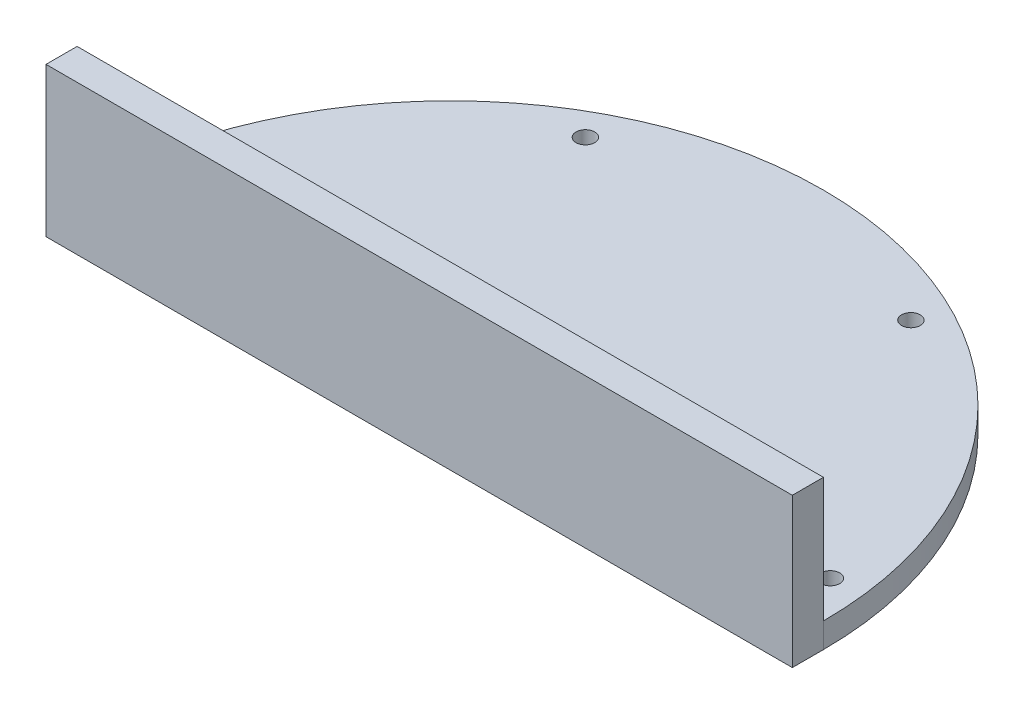
ISO-10303-21;
HEADER;
FILE_DESCRIPTION(('STEP AP214'),'2;1');
FILE_NAME('part.step','',(''),(''),'','','');
FILE_SCHEMA(('AUTOMOTIVE_DESIGN { 1 0 10303 214 1 1 1 1 }'));
ENDSEC;
DATA;
#1=APPLICATION_CONTEXT('core data for automotive mechanical design processes');
#2=APPLICATION_PROTOCOL_DEFINITION('international standard','automotive_design',2000,#1);
#3=PRODUCT_CONTEXT('',#1,'mechanical');
#4=PRODUCT('Part','Part','',(#3));
#5=PRODUCT_RELATED_PRODUCT_CATEGORY('part','',(#4));
#6=PRODUCT_DEFINITION_FORMATION('','',#4);
#7=PRODUCT_DEFINITION_CONTEXT('part definition',#1,'design');
#8=PRODUCT_DEFINITION('design','',#6,#7);
#9=PRODUCT_DEFINITION_SHAPE('','',#8);
#10=(LENGTH_UNIT() NAMED_UNIT(*) SI_UNIT(.MILLI.,.METRE.));
#11=(NAMED_UNIT(*) PLANE_ANGLE_UNIT() SI_UNIT($,.RADIAN.));
#12=(NAMED_UNIT(*) SI_UNIT($,.STERADIAN.) SOLID_ANGLE_UNIT());
#13=UNCERTAINTY_MEASURE_WITH_UNIT(LENGTH_MEASURE(1.E-05),#10,'distance_accuracy_value','');
#14=(GEOMETRIC_REPRESENTATION_CONTEXT(3) GLOBAL_UNCERTAINTY_ASSIGNED_CONTEXT((#13)) GLOBAL_UNIT_ASSIGNED_CONTEXT((#10,
#11,#12)) REPRESENTATION_CONTEXT('',''));
#15=CARTESIAN_POINT('',(0.,0.,0.));
#16=DIRECTION('',(0.,0.,1.));
#17=DIRECTION('',(1.,0.,0.));
#18=AXIS2_PLACEMENT_3D('',#15,#16,#17);
#19=CARTESIAN_POINT('',(0.,5.,0.));
#20=DIRECTION('',(0.,-1.,0.));
#21=DIRECTION('',(0.,0.,-1.));
#22=AXIS2_PLACEMENT_3D('',#19,#20,#21);
#23=CYLINDRICAL_SURFACE('',#22,60.);
#24=DIRECTION('',(0.,-1.,0.));
#25=VECTOR('',#24,1.);
#26=CARTESIAN_POINT('',(60.,5.,0.));
#27=LINE('',#26,#25);
#28=CARTESIAN_POINT('',(60.,10.,0.));
#29=VERTEX_POINT('',#28);
#30=CARTESIAN_POINT('',(60.,5.99999999999998,0.));
#31=VERTEX_POINT('',#30);
#32=EDGE_CURVE('E108',#29,#31,#27,.T.);
#33=ORIENTED_EDGE('',*,*,#32,.T.);
#34=CARTESIAN_POINT('',(0.,5.99999999999998,0.));
#35=DIRECTION('',(0.,1.,0.));
#36=DIRECTION('',(0.,0.,1.));
#37=AXIS2_PLACEMENT_3D('',#34,#35,#36);
#38=CIRCLE('',#37,60.);
#39=CARTESIAN_POINT('',(-60.,5.99999999999998,0.));
#40=VERTEX_POINT('',#39);
#41=EDGE_CURVE('E182',#31,#40,#38,.T.);
#42=ORIENTED_EDGE('',*,*,#41,.T.);
#43=DIRECTION('',(0.,-1.,0.));
#44=VECTOR('',#43,1.);
#45=CARTESIAN_POINT('',(-60.,5.,0.));
#46=LINE('',#45,#44);
#47=CARTESIAN_POINT('',(-60.,10.,0.));
#48=VERTEX_POINT('',#47);
#49=EDGE_CURVE('E153',#48,#40,#46,.T.);
#50=ORIENTED_EDGE('',*,*,#49,.F.);
#51=CARTESIAN_POINT('',(0.,10.,0.));
#52=DIRECTION('',(0.,1.,0.));
#53=DIRECTION('',(0.,0.,1.));
#54=AXIS2_PLACEMENT_3D('',#51,#52,#53);
#55=CIRCLE('',#54,60.);
#56=EDGE_CURVE('E144',#29,#48,#55,.T.);
#57=ORIENTED_EDGE('',*,*,#56,.F.);
#58=EDGE_LOOP('',(#33,#42,#50,#57));
#59=FACE_BOUND('',#58,.T.);
#60=ADVANCED_FACE('F40',(#59),#23,.T.);
#61=CARTESIAN_POINT('',(-54.7722557505166,0.,-5.));
#62=DIRECTION('',(0.,1.,0.));
#63=DIRECTION('',(0.,0.,1.));
#64=AXIS2_PLACEMENT_3D('',#61,#62,#63);
#65=CYLINDRICAL_SURFACE('',#64,1.5);
#66=CARTESIAN_POINT('',(-54.7722557505166,6.00000000000002,-5.));
#67=DIRECTION('',(0.,1.,0.));
#68=DIRECTION('',(0.,0.,1.));
#69=AXIS2_PLACEMENT_3D('',#66,#67,#68);
#70=CIRCLE('',#69,1.5);
#71=CARTESIAN_POINT('',(-54.7722557505166,6.00000000000002,-3.5));
#72=VERTEX_POINT('',#71);
#73=EDGE_CURVE('E155',#72,#72,#70,.F.);
#74=ORIENTED_EDGE('',*,*,#73,.T.);
#75=EDGE_LOOP('',(#74));
#76=FACE_BOUND('',#75,.T.);
#77=CARTESIAN_POINT('',(-54.7722557505166,10.,-5.));
#78=DIRECTION('',(0.,1.,0.));
#79=DIRECTION('',(0.,0.,1.));
#80=AXIS2_PLACEMENT_3D('',#77,#78,#79);
#81=CIRCLE('',#80,1.5);
#82=CARTESIAN_POINT('',(-54.7722557505166,10.,-3.5));
#83=VERTEX_POINT('',#82);
#84=EDGE_CURVE('E136',#83,#83,#81,.T.);
#85=ORIENTED_EDGE('',*,*,#84,.T.);
#86=EDGE_LOOP('',(#85));
#87=FACE_BOUND('',#86,.T.);
#88=ADVANCED_FACE('F239',(#76,#87),#65,.F.);
#89=CARTESIAN_POINT('',(54.6149090032351,0.,-6.49705429932328));
#90=DIRECTION('',(0.,1.,0.));
#91=DIRECTION('',(0.,0.,1.));
#92=AXIS2_PLACEMENT_3D('',#89,#90,#91);
#93=CYLINDRICAL_SURFACE('',#92,1.5);
#94=CARTESIAN_POINT('',(54.6149090032351,6.00000000000002,-6.49705429932328));
#95=DIRECTION('',(0.,1.,0.));
#96=DIRECTION('',(0.,0.,1.));
#97=AXIS2_PLACEMENT_3D('',#94,#95,#96);
#98=CIRCLE('',#97,1.5);
#99=CARTESIAN_POINT('',(54.6149090032351,6.00000000000002,-4.99705429932328));
#100=VERTEX_POINT('',#99);
#101=EDGE_CURVE('E11',#100,#100,#98,.F.);
#102=ORIENTED_EDGE('',*,*,#101,.T.);
#103=EDGE_LOOP('',(#102));
#104=FACE_BOUND('',#103,.T.);
#105=CARTESIAN_POINT('',(54.6149090032351,10.,-6.49705429932328));
#106=DIRECTION('',(0.,1.,0.));
#107=DIRECTION('',(-0.207911690817753,0.,-0.978147600733807));
#108=AXIS2_PLACEMENT_3D('',#105,#106,#107);
#109=CIRCLE('',#108,1.5);
#110=CARTESIAN_POINT('',(54.3030414670084,10.,-7.964275700424));
#111=VERTEX_POINT('',#110);
#112=EDGE_CURVE('E119',#111,#111,#109,.T.);
#113=ORIENTED_EDGE('',*,*,#112,.T.);
#114=EDGE_LOOP('',(#113));
#115=FACE_BOUND('',#114,.T.);
#116=ADVANCED_FACE('F244',(#104,#115),#93,.F.);
#117=CARTESIAN_POINT('',(25.1539674132403,0.,-48.9109182430022));
#118=DIRECTION('',(0.,1.,0.));
#119=DIRECTION('',(0.,0.,1.));
#120=AXIS2_PLACEMENT_3D('',#117,#118,#119);
#121=CYLINDRICAL_SURFACE('',#120,1.5);
#122=CARTESIAN_POINT('',(25.1539674132403,6.00000000000002,-48.9109182430022));
#123=DIRECTION('',(0.,1.,0.));
#124=DIRECTION('',(0.,0.,1.));
#125=AXIS2_PLACEMENT_3D('',#122,#123,#124);
#126=CIRCLE('',#125,1.5);
#127=CARTESIAN_POINT('',(25.1539674132403,6.00000000000002,-47.4109182430022));
#128=VERTEX_POINT('',#127);
#129=EDGE_CURVE('E179',#128,#128,#126,.F.);
#130=ORIENTED_EDGE('',*,*,#129,.T.);
#131=EDGE_LOOP('',(#130));
#132=FACE_BOUND('',#131,.T.);
#133=CARTESIAN_POINT('',(25.1539674132403,10.,-48.9109182430022));
#134=DIRECTION('',(0.,1.,0.));
#135=DIRECTION('',(-0.927183854566786,0.,-0.374606593415916));
#136=AXIS2_PLACEMENT_3D('',#133,#134,#135);
#137=CIRCLE('',#136,1.5);
#138=CARTESIAN_POINT('',(23.7631916313901,10.,-49.4728281331261));
#139=VERTEX_POINT('',#138);
#140=EDGE_CURVE('E137',#139,#139,#137,.T.);
#141=ORIENTED_EDGE('',*,*,#140,.T.);
#142=EDGE_LOOP('',(#141));
#143=FACE_BOUND('',#142,.T.);
#144=ADVANCED_FACE('F299',(#132,#143),#121,.F.);
#145=CARTESIAN_POINT('',(-26.4830688599984,0.,-48.204222468126));
#146=DIRECTION('',(0.,1.,0.));
#147=DIRECTION('',(0.,0.,1.));
#148=AXIS2_PLACEMENT_3D('',#145,#146,#147);
#149=CYLINDRICAL_SURFACE('',#148,1.5);
#150=CARTESIAN_POINT('',(-26.4830688599984,6.00000000000002,-48.204222468126));
#151=DIRECTION('',(0.,1.,0.));
#152=DIRECTION('',(0.,0.,1.));
#153=AXIS2_PLACEMENT_3D('',#150,#151,#152);
#154=CIRCLE('',#153,1.5);
#155=CARTESIAN_POINT('',(-26.4830688599984,6.00000000000002,-46.704222468126));
#156=VERTEX_POINT('',#155);
#157=EDGE_CURVE('E50',#156,#156,#154,.F.);
#158=ORIENTED_EDGE('',*,*,#157,.T.);
#159=EDGE_LOOP('',(#158));
#160=FACE_BOUND('',#159,.T.);
#161=CARTESIAN_POINT('',(-26.4830688599984,10.,-48.204222468126));
#162=DIRECTION('',(0.,1.,0.));
#163=DIRECTION('',(-0.829037572555043,0.,0.559192903470745));
#164=AXIS2_PLACEMENT_3D('',#161,#162,#163);
#165=CIRCLE('',#164,1.5);
#166=CARTESIAN_POINT('',(-27.7266252188309,10.,-47.3654331129199));
#167=VERTEX_POINT('',#166);
#168=EDGE_CURVE('E133',#167,#167,#165,.T.);
#169=ORIENTED_EDGE('',*,*,#168,.T.);
#170=EDGE_LOOP('',(#169));
#171=FACE_BOUND('',#170,.T.);
#172=ADVANCED_FACE('F296',(#160,#171),#149,.F.);
#173=CARTESIAN_POINT('',(-60.,5.,5.));
#174=DIRECTION('',(1.,0.,0.));
#175=DIRECTION('',(0.,0.,-1.));
#176=AXIS2_PLACEMENT_3D('',#173,#174,#175);
#177=PLANE('',#176);
#178=ORIENTED_EDGE('',*,*,#49,.T.);
#179=DIRECTION('',(0.,0.,1.));
#180=VECTOR('',#179,1.);
#181=CARTESIAN_POINT('',(-60.,5.99999999999998,5.));
#182=LINE('',#181,#180);
#183=CARTESIAN_POINT('',(-60.,5.99999999999998,5.));
#184=VERTEX_POINT('',#183);
#185=EDGE_CURVE('E66',#40,#184,#182,.T.);
#186=ORIENTED_EDGE('',*,*,#185,.T.);
#187=DIRECTION('',(0.,-1.,0.));
#188=VECTOR('',#187,1.);
#189=CARTESIAN_POINT('',(-60.,5.,5.));
#190=LINE('',#189,#188);
#191=CARTESIAN_POINT('',(-60.,30.,5.));
#192=VERTEX_POINT('',#191);
#193=EDGE_CURVE('E109',#192,#184,#190,.T.);
#194=ORIENTED_EDGE('',*,*,#193,.F.);
#195=DIRECTION('',(0.,0.,-1.));
#196=VECTOR('',#195,1.);
#197=CARTESIAN_POINT('',(-60.,30.,5.));
#198=LINE('',#197,#196);
#199=CARTESIAN_POINT('',(-60.,30.,0.));
#200=VERTEX_POINT('',#199);
#201=EDGE_CURVE('E120',#192,#200,#198,.T.);
#202=ORIENTED_EDGE('',*,*,#201,.T.);
#203=DIRECTION('',(0.,1.,0.));
#204=VECTOR('',#203,1.);
#205=CARTESIAN_POINT('',(-60.,5.,0.));
#206=LINE('',#205,#204);
#207=EDGE_CURVE('E130',#48,#200,#206,.T.);
#208=ORIENTED_EDGE('',*,*,#207,.F.);
#209=EDGE_LOOP('',(#178,#186,#194,#202,#208));
#210=FACE_BOUND('',#209,.T.);
#211=ADVANCED_FACE('F220',(#210),#177,.F.);
#212=CARTESIAN_POINT('',(60.,5.,5.));
#213=DIRECTION('',(-1.,0.,0.));
#214=DIRECTION('',(0.,0.,1.));
#215=AXIS2_PLACEMENT_3D('',#212,#213,#214);
#216=PLANE('',#215);
#217=DIRECTION('',(0.,1.,0.));
#218=VECTOR('',#217,1.);
#219=CARTESIAN_POINT('',(60.,5.,5.));
#220=LINE('',#219,#218);
#221=CARTESIAN_POINT('',(60.,5.99999999999998,5.));
#222=VERTEX_POINT('',#221);
#223=CARTESIAN_POINT('',(60.,30.,5.));
#224=VERTEX_POINT('',#223);
#225=EDGE_CURVE('E101',#222,#224,#220,.T.);
#226=ORIENTED_EDGE('',*,*,#225,.F.);
#227=DIRECTION('',(0.,0.,-1.));
#228=VECTOR('',#227,1.);
#229=CARTESIAN_POINT('',(60.,5.99999999999998,5.));
#230=LINE('',#229,#228);
#231=EDGE_CURVE('E187',#222,#31,#230,.T.);
#232=ORIENTED_EDGE('',*,*,#231,.T.);
#233=ORIENTED_EDGE('',*,*,#32,.F.);
#234=DIRECTION('',(0.,-1.,0.));
#235=VECTOR('',#234,1.);
#236=CARTESIAN_POINT('',(60.,5.,0.));
#237=LINE('',#236,#235);
#238=CARTESIAN_POINT('',(60.,30.,0.));
#239=VERTEX_POINT('',#238);
#240=EDGE_CURVE('E115',#239,#29,#237,.T.);
#241=ORIENTED_EDGE('',*,*,#240,.F.);
#242=DIRECTION('',(0.,0.,-1.));
#243=VECTOR('',#242,1.);
#244=CARTESIAN_POINT('',(60.,30.,5.));
#245=LINE('',#244,#243);
#246=EDGE_CURVE('E112',#224,#239,#245,.T.);
#247=ORIENTED_EDGE('',*,*,#246,.F.);
#248=EDGE_LOOP('',(#226,#232,#233,#241,#247));
#249=FACE_BOUND('',#248,.T.);
#250=ADVANCED_FACE('F113',(#249),#216,.F.);
#251=CARTESIAN_POINT('',(0.,0.,5.));
#252=DIRECTION('',(0.,0.,1.));
#253=DIRECTION('',(1.,0.,0.));
#254=AXIS2_PLACEMENT_3D('',#251,#252,#253);
#255=PLANE('',#254);
#256=ORIENTED_EDGE('',*,*,#193,.T.);
#257=DIRECTION('',(1.,0.,0.));
#258=VECTOR('',#257,1.);
#259=CARTESIAN_POINT('',(60.,5.99999999999998,5.));
#260=LINE('',#259,#258);
#261=EDGE_CURVE('E58',#184,#222,#260,.T.);
#262=ORIENTED_EDGE('',*,*,#261,.T.);
#263=ORIENTED_EDGE('',*,*,#225,.T.);
#264=DIRECTION('',(1.,0.,0.));
#265=VECTOR('',#264,1.);
#266=CARTESIAN_POINT('',(-60.,30.,5.));
#267=LINE('',#266,#265);
#268=EDGE_CURVE('E105',#192,#224,#267,.T.);
#269=ORIENTED_EDGE('',*,*,#268,.F.);
#270=EDGE_LOOP('',(#256,#262,#263,#269));
#271=FACE_BOUND('',#270,.T.);
#272=ADVANCED_FACE('F103',(#271),#255,.T.);
#273=CARTESIAN_POINT('',(0.,10.,0.));
#274=DIRECTION('',(0.,-1.,0.));
#275=DIRECTION('',(0.,0.,1.));
#276=AXIS2_PLACEMENT_3D('',#273,#274,#275);
#277=PLANE('',#276);
#278=ORIENTED_EDGE('',*,*,#168,.F.);
#279=EDGE_LOOP('',(#278));
#280=FACE_BOUND('',#279,.T.);
#281=ORIENTED_EDGE('',*,*,#140,.F.);
#282=EDGE_LOOP('',(#281));
#283=FACE_BOUND('',#282,.T.);
#284=ORIENTED_EDGE('',*,*,#112,.F.);
#285=EDGE_LOOP('',(#284));
#286=FACE_BOUND('',#285,.T.);
#287=ORIENTED_EDGE('',*,*,#84,.F.);
#288=EDGE_LOOP('',(#287));
#289=FACE_BOUND('',#288,.T.);
#290=ORIENTED_EDGE('',*,*,#56,.T.);
#291=DIRECTION('',(1.,0.,0.));
#292=VECTOR('',#291,1.);
#293=CARTESIAN_POINT('',(-60.,10.,0.));
#294=LINE('',#293,#292);
#295=EDGE_CURVE('E147',#48,#29,#294,.T.);
#296=ORIENTED_EDGE('',*,*,#295,.T.);
#297=EDGE_LOOP('',(#290,#296));
#298=FACE_BOUND('',#297,.T.);
#299=ADVANCED_FACE('F225',(#280,#283,#286,#289,#298),#277,.F.);
#300=CARTESIAN_POINT('',(0.,10.,0.));
#301=DIRECTION('',(0.,0.,1.));
#302=DIRECTION('',(1.,0.,0.));
#303=AXIS2_PLACEMENT_3D('',#300,#301,#302);
#304=PLANE('',#303);
#305=ORIENTED_EDGE('',*,*,#240,.T.);
#306=ORIENTED_EDGE('',*,*,#295,.F.);
#307=ORIENTED_EDGE('',*,*,#207,.T.);
#308=DIRECTION('',(1.,0.,0.));
#309=VECTOR('',#308,1.);
#310=CARTESIAN_POINT('',(-60.,30.,0.));
#311=LINE('',#310,#309);
#312=EDGE_CURVE('E125',#200,#239,#311,.T.);
#313=ORIENTED_EDGE('',*,*,#312,.T.);
#314=EDGE_LOOP('',(#305,#306,#307,#313));
#315=FACE_BOUND('',#314,.T.);
#316=ADVANCED_FACE('F223',(#315),#304,.F.);
#317=CARTESIAN_POINT('',(-60.,30.,5.));
#318=DIRECTION('',(0.,1.,0.));
#319=DIRECTION('',(0.,0.,1.));
#320=AXIS2_PLACEMENT_3D('',#317,#318,#319);
#321=PLANE('',#320);
#322=ORIENTED_EDGE('',*,*,#312,.F.);
#323=ORIENTED_EDGE('',*,*,#201,.F.);
#324=ORIENTED_EDGE('',*,*,#268,.T.);
#325=ORIENTED_EDGE('',*,*,#246,.T.);
#326=EDGE_LOOP('',(#322,#323,#324,#325));
#327=FACE_BOUND('',#326,.T.);
#328=ADVANCED_FACE('F123',(#327),#321,.T.);
#329=CARTESIAN_POINT('',(90.,5.,5.));
#330=DIRECTION('',(0.,1.,0.));
#331=DIRECTION('',(0.,0.,1.));
#332=AXIS2_PLACEMENT_3D('',#329,#330,#331);
#333=PLANE('',#332);
#334=CARTESIAN_POINT('',(-54.7722557505166,5.,-5.));
#335=DIRECTION('',(0.,1.,0.));
#336=DIRECTION('',(0.,0.,1.));
#337=AXIS2_PLACEMENT_3D('',#334,#335,#336);
#338=CIRCLE('',#337,2.50000000000003);
#339=CARTESIAN_POINT('',(-54.7722557505166,5.,-2.49999999999997));
#340=VERTEX_POINT('',#339);
#341=EDGE_CURVE('E176',#340,#340,#338,.T.);
#342=ORIENTED_EDGE('',*,*,#341,.T.);
#343=EDGE_LOOP('',(#342));
#344=FACE_BOUND('',#343,.T.);
#345=CARTESIAN_POINT('',(25.1539674132403,5.,-48.9109182430022));
#346=DIRECTION('',(0.,1.,0.));
#347=DIRECTION('',(0.,0.,1.));
#348=AXIS2_PLACEMENT_3D('',#345,#346,#347);
#349=CIRCLE('',#348,2.50000000000003);
#350=CARTESIAN_POINT('',(25.1539674132403,5.,-46.4109182430022));
#351=VERTEX_POINT('',#350);
#352=EDGE_CURVE('E173',#351,#351,#349,.T.);
#353=ORIENTED_EDGE('',*,*,#352,.T.);
#354=EDGE_LOOP('',(#353));
#355=FACE_BOUND('',#354,.T.);
#356=DIRECTION('',(0.,0.,-1.));
#357=VECTOR('',#356,1.);
#358=CARTESIAN_POINT('',(-59.,5.,5.));
#359=LINE('',#358,#357);
#360=CARTESIAN_POINT('',(-59.,5.,4.));
#361=VERTEX_POINT('',#360);
#362=CARTESIAN_POINT('',(-59.,5.,0.));
#363=VERTEX_POINT('',#362);
#364=EDGE_CURVE('E168',#361,#363,#359,.T.);
#365=ORIENTED_EDGE('',*,*,#364,.T.);
#366=CARTESIAN_POINT('',(0.,5.,0.));
#367=DIRECTION('',(0.,1.,0.));
#368=DIRECTION('',(0.,0.,1.));
#369=AXIS2_PLACEMENT_3D('',#366,#367,#368);
#370=CIRCLE('',#369,59.);
#371=CARTESIAN_POINT('',(59.,5.,0.));
#372=VERTEX_POINT('',#371);
#373=EDGE_CURVE('E170',#363,#372,#370,.F.);
#374=ORIENTED_EDGE('',*,*,#373,.T.);
#375=DIRECTION('',(0.,0.,1.));
#376=VECTOR('',#375,1.);
#377=CARTESIAN_POINT('',(59.,5.,5.));
#378=LINE('',#377,#376);
#379=CARTESIAN_POINT('',(59.,5.,4.));
#380=VERTEX_POINT('',#379);
#381=EDGE_CURVE('E164',#372,#380,#378,.T.);
#382=ORIENTED_EDGE('',*,*,#381,.T.);
#383=DIRECTION('',(-1.,0.,0.));
#384=VECTOR('',#383,1.);
#385=CARTESIAN_POINT('',(-60.,5.,4.));
#386=LINE('',#385,#384);
#387=EDGE_CURVE('E166',#380,#361,#386,.T.);
#388=ORIENTED_EDGE('',*,*,#387,.T.);
#389=EDGE_LOOP('',(#365,#374,#382,#388));
#390=FACE_BOUND('',#389,.T.);
#391=CARTESIAN_POINT('',(-26.4830688599984,5.,-48.204222468126));
#392=DIRECTION('',(0.,1.,0.));
#393=DIRECTION('',(0.,0.,1.));
#394=AXIS2_PLACEMENT_3D('',#391,#392,#393);
#395=CIRCLE('',#394,2.50000000000003);
#396=CARTESIAN_POINT('',(-26.4830688599984,5.,-45.704222468126));
#397=VERTEX_POINT('',#396);
#398=EDGE_CURVE('E161',#397,#397,#395,.T.);
#399=ORIENTED_EDGE('',*,*,#398,.T.);
#400=EDGE_LOOP('',(#399));
#401=FACE_BOUND('',#400,.T.);
#402=CARTESIAN_POINT('',(54.6149090032351,5.,-6.49705429932328));
#403=DIRECTION('',(0.,1.,0.));
#404=DIRECTION('',(0.,0.,1.));
#405=AXIS2_PLACEMENT_3D('',#402,#403,#404);
#406=CIRCLE('',#405,2.50000000000003);
#407=CARTESIAN_POINT('',(54.6149090032351,5.,-3.99705429932325));
#408=VERTEX_POINT('',#407);
#409=EDGE_CURVE('E158',#408,#408,#406,.T.);
#410=ORIENTED_EDGE('',*,*,#409,.T.);
#411=EDGE_LOOP('',(#410));
#412=FACE_BOUND('',#411,.T.);
#413=ADVANCED_FACE('F209',(#344,#355,#390,#401,#412),#333,.F.);
#414=CARTESIAN_POINT('',(-54.7722557505166,6.00000000000002,-5.));
#415=DIRECTION('',(0.,-1.,0.));
#416=DIRECTION('',(0.,0.,-1.));
#417=AXIS2_PLACEMENT_3D('',#414,#415,#416);
#418=CONICAL_SURFACE('',#417,1.5,0.785398163397453);
#419=ORIENTED_EDGE('',*,*,#341,.F.);
#420=EDGE_LOOP('',(#419));
#421=FACE_BOUND('',#420,.T.);
#422=ORIENTED_EDGE('',*,*,#73,.F.);
#423=EDGE_LOOP('',(#422));
#424=FACE_BOUND('',#423,.T.);
#425=ADVANCED_FACE('F250',(#421,#424),#418,.F.);
#426=CARTESIAN_POINT('',(25.1539674132403,6.00000000000002,-48.9109182430022));
#427=DIRECTION('',(0.,-1.,0.));
#428=DIRECTION('',(0.,0.,-1.));
#429=AXIS2_PLACEMENT_3D('',#426,#427,#428);
#430=CONICAL_SURFACE('',#429,1.5,0.785398163397453);
#431=ORIENTED_EDGE('',*,*,#352,.F.);
#432=EDGE_LOOP('',(#431));
#433=FACE_BOUND('',#432,.T.);
#434=ORIENTED_EDGE('',*,*,#129,.F.);
#435=EDGE_LOOP('',(#434));
#436=FACE_BOUND('',#435,.T.);
#437=ADVANCED_FACE('F256',(#433,#436),#430,.F.);
#438=CARTESIAN_POINT('',(90.,5.,4.));
#439=DIRECTION('',(0.,-0.707106781186552,0.707106781186543));
#440=DIRECTION('',(1.,0.,0.));
#441=AXIS2_PLACEMENT_3D('',#438,#439,#440);
#442=PLANE('',#441);
#443=DIRECTION('',(-0.577350269189628,0.57735026918962,0.577350269189628));
#444=VECTOR('',#443,1.);
#445=CARTESIAN_POINT('',(-9.33333333333287,-44.6666666666664,-45.6666666666671));
#446=LINE('',#445,#444);
#447=EDGE_CURVE('E194',#361,#184,#446,.T.);
#448=ORIENTED_EDGE('',*,*,#447,.F.);
#449=ORIENTED_EDGE('',*,*,#387,.F.);
#450=DIRECTION('',(0.577350269189628,0.57735026918962,0.577350269189628));
#451=VECTOR('',#450,1.);
#452=CARTESIAN_POINT('',(60.,5.99999999999998,5.));
#453=LINE('',#452,#451);
#454=EDGE_CURVE('E45',#222,#380,#453,.F.);
#455=ORIENTED_EDGE('',*,*,#454,.F.);
#456=ORIENTED_EDGE('',*,*,#261,.F.);
#457=EDGE_LOOP('',(#448,#449,#455,#456));
#458=FACE_BOUND('',#457,.T.);
#459=ADVANCED_FACE('F207',(#458),#442,.T.);
#460=CARTESIAN_POINT('',(60.,5.99999999999998,5.));
#461=DIRECTION('',(-0.707106781186543,0.707106781186552,0.));
#462=DIRECTION('',(0.,0.,-1.));
#463=AXIS2_PLACEMENT_3D('',#460,#461,#462);
#464=PLANE('',#463);
#465=ORIENTED_EDGE('',*,*,#454,.T.);
#466=ORIENTED_EDGE('',*,*,#381,.F.);
#467=DIRECTION('',(-0.707106781186552,-0.707106781186543,0.));
#468=VECTOR('',#467,1.);
#469=CARTESIAN_POINT('',(60.,5.99999999999998,0.));
#470=LINE('',#469,#468);
#471=EDGE_CURVE('E193',#31,#372,#470,.T.);
#472=ORIENTED_EDGE('',*,*,#471,.F.);
#473=ORIENTED_EDGE('',*,*,#231,.F.);
#474=EDGE_LOOP('',(#465,#466,#472,#473));
#475=FACE_BOUND('',#474,.T.);
#476=ADVANCED_FACE('F203',(#475),#464,.F.);
#477=CARTESIAN_POINT('',(-59.,5.,5.));
#478=DIRECTION('',(0.707106781186543,0.707106781186552,0.));
#479=DIRECTION('',(0.,0.,-1.));
#480=AXIS2_PLACEMENT_3D('',#477,#478,#479);
#481=PLANE('',#480);
#482=ORIENTED_EDGE('',*,*,#447,.T.);
#483=ORIENTED_EDGE('',*,*,#185,.F.);
#484=DIRECTION('',(-0.707106781186552,0.707106781186543,0.));
#485=VECTOR('',#484,1.);
#486=CARTESIAN_POINT('',(-59.,5.,0.));
#487=LINE('',#486,#485);
#488=EDGE_CURVE('E191',#363,#40,#487,.T.);
#489=ORIENTED_EDGE('',*,*,#488,.F.);
#490=ORIENTED_EDGE('',*,*,#364,.F.);
#491=EDGE_LOOP('',(#482,#483,#489,#490));
#492=FACE_BOUND('',#491,.T.);
#493=ADVANCED_FACE('F216',(#492),#481,.F.);
#494=CARTESIAN_POINT('',(0.,5.99999999999998,0.));
#495=DIRECTION('',(0.,1.,0.));
#496=DIRECTION('',(0.,0.,1.));
#497=AXIS2_PLACEMENT_3D('',#494,#495,#496);
#498=CONICAL_SURFACE('',#497,60.,0.785398163397455);
#499=ORIENTED_EDGE('',*,*,#471,.T.);
#500=ORIENTED_EDGE('',*,*,#373,.F.);
#501=ORIENTED_EDGE('',*,*,#488,.T.);
#502=ORIENTED_EDGE('',*,*,#41,.F.);
#503=EDGE_LOOP('',(#499,#500,#501,#502));
#504=FACE_BOUND('',#503,.T.);
#505=ADVANCED_FACE('F214',(#504),#498,.T.);
#506=CARTESIAN_POINT('',(-26.4830688599984,6.00000000000002,-48.204222468126));
#507=DIRECTION('',(0.,-1.,0.));
#508=DIRECTION('',(0.,0.,-1.));
#509=AXIS2_PLACEMENT_3D('',#506,#507,#508);
#510=CONICAL_SURFACE('',#509,1.5,0.785398163397453);
#511=ORIENTED_EDGE('',*,*,#398,.F.);
#512=EDGE_LOOP('',(#511));
#513=FACE_BOUND('',#512,.T.);
#514=ORIENTED_EDGE('',*,*,#157,.F.);
#515=EDGE_LOOP('',(#514));
#516=FACE_BOUND('',#515,.T.);
#517=ADVANCED_FACE('F271',(#513,#516),#510,.F.);
#518=CARTESIAN_POINT('',(54.6149090032351,6.00000000000002,-6.49705429932328));
#519=DIRECTION('',(0.,-1.,0.));
#520=DIRECTION('',(0.,0.,-1.));
#521=AXIS2_PLACEMENT_3D('',#518,#519,#520);
#522=CONICAL_SURFACE('',#521,1.5,0.785398163397453);
#523=ORIENTED_EDGE('',*,*,#409,.F.);
#524=EDGE_LOOP('',(#523));
#525=FACE_BOUND('',#524,.T.);
#526=ORIENTED_EDGE('',*,*,#101,.F.);
#527=EDGE_LOOP('',(#526));
#528=FACE_BOUND('',#527,.T.);
#529=ADVANCED_FACE('F43',(#525,#528),#522,.F.);
#530=CLOSED_SHELL('',(#60,#88,#116,#144,#172,#211,#250,#272,#299,#316,#328,#413,#425,#437,#459,
#476,#493,#505,#517,#529));
#531=MANIFOLD_SOLID_BREP('B2',#530);
#532=ADVANCED_BREP_SHAPE_REPRESENTATION('',(#18,#531),#14);
#533=SHAPE_DEFINITION_REPRESENTATION(#9,#532);
ENDSEC;
END-ISO-10303-21;
